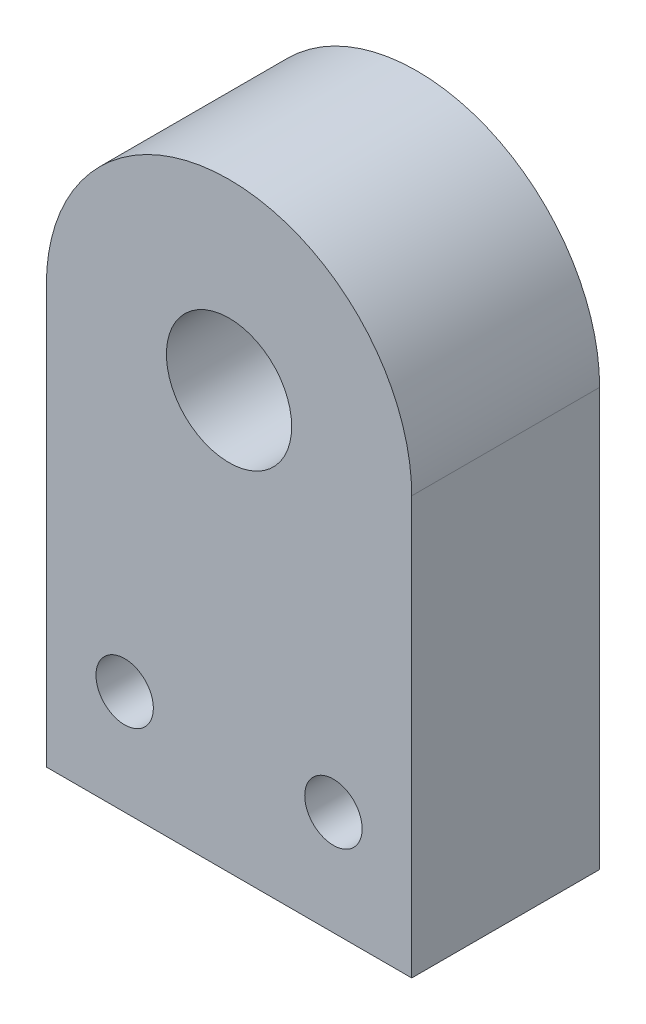
ISO-10303-21;
HEADER;
FILE_DESCRIPTION(('STEP AP214'),'2;1');
FILE_NAME('part.step','',(''),(''),'','','');
FILE_SCHEMA(('AUTOMOTIVE_DESIGN { 1 0 10303 214 1 1 1 1 }'));
ENDSEC;
DATA;
#1=APPLICATION_CONTEXT('core data for automotive mechanical design processes');
#2=APPLICATION_PROTOCOL_DEFINITION('international standard','automotive_design',2000,#1);
#3=PRODUCT_CONTEXT('',#1,'mechanical');
#4=PRODUCT('Part','Part','',(#3));
#5=PRODUCT_RELATED_PRODUCT_CATEGORY('part','',(#4));
#6=PRODUCT_DEFINITION_FORMATION('','',#4);
#7=PRODUCT_DEFINITION_CONTEXT('part definition',#1,'design');
#8=PRODUCT_DEFINITION('design','',#6,#7);
#9=PRODUCT_DEFINITION_SHAPE('','',#8);
#10=(LENGTH_UNIT() NAMED_UNIT(*) SI_UNIT(.MILLI.,.METRE.));
#11=(NAMED_UNIT(*) PLANE_ANGLE_UNIT() SI_UNIT($,.RADIAN.));
#12=(NAMED_UNIT(*) SI_UNIT($,.STERADIAN.) SOLID_ANGLE_UNIT());
#13=UNCERTAINTY_MEASURE_WITH_UNIT(LENGTH_MEASURE(1.E-05),#10,'distance_accuracy_value','');
#14=(GEOMETRIC_REPRESENTATION_CONTEXT(3) GLOBAL_UNCERTAINTY_ASSIGNED_CONTEXT((#13)) GLOBAL_UNIT_ASSIGNED_CONTEXT((#10,
#11,#12)) REPRESENTATION_CONTEXT('',''));
#15=CARTESIAN_POINT('',(0.,0.,0.));
#16=DIRECTION('',(0.,0.,1.));
#17=DIRECTION('',(1.,0.,0.));
#18=AXIS2_PLACEMENT_3D('',#15,#16,#17);
#19=CARTESIAN_POINT('',(0.,0.,18.));
#20=DIRECTION('',(0.,0.,1.));
#21=DIRECTION('',(1.,0.,0.));
#22=AXIS2_PLACEMENT_3D('',#19,#20,#21);
#23=PLANE('',#22);
#24=CARTESIAN_POINT('',(-9.99999999999999,-30.,18.));
#25=DIRECTION('',(0.,0.,1.));
#26=DIRECTION('',(1.,0.,0.));
#27=AXIS2_PLACEMENT_3D('',#24,#25,#26);
#28=CIRCLE('',#27,2.75);
#29=CARTESIAN_POINT('',(-7.24999999999999,-30.,18.));
#30=VERTEX_POINT('',#29);
#31=EDGE_CURVE('E117',#30,#30,#28,.T.);
#32=ORIENTED_EDGE('',*,*,#31,.F.);
#33=EDGE_LOOP('',(#32));
#34=FACE_BOUND('',#33,.T.);
#35=CARTESIAN_POINT('',(0.,0.,18.));
#36=DIRECTION('',(0.,0.,1.));
#37=DIRECTION('',(1.,0.,0.));
#38=AXIS2_PLACEMENT_3D('',#35,#36,#37);
#39=CIRCLE('',#38,17.5);
#40=CARTESIAN_POINT('',(17.5,0.,18.));
#41=VERTEX_POINT('',#40);
#42=CARTESIAN_POINT('',(-17.5,0.,18.));
#43=VERTEX_POINT('',#42);
#44=EDGE_CURVE('E87',#41,#43,#39,.T.);
#45=ORIENTED_EDGE('',*,*,#44,.T.);
#46=DIRECTION('',(0.,-1.,0.));
#47=VECTOR('',#46,1.);
#48=CARTESIAN_POINT('',(-17.5,0.,18.));
#49=LINE('',#48,#47);
#50=CARTESIAN_POINT('',(-17.5,-40.,18.));
#51=VERTEX_POINT('',#50);
#52=EDGE_CURVE('E82',#43,#51,#49,.T.);
#53=ORIENTED_EDGE('',*,*,#52,.T.);
#54=DIRECTION('',(1.,0.,0.));
#55=VECTOR('',#54,1.);
#56=CARTESIAN_POINT('',(-17.5,-40.,18.));
#57=LINE('',#56,#55);
#58=CARTESIAN_POINT('',(17.5,-40.,18.));
#59=VERTEX_POINT('',#58);
#60=EDGE_CURVE('E85',#51,#59,#57,.T.);
#61=ORIENTED_EDGE('',*,*,#60,.T.);
#62=DIRECTION('',(0.,1.,0.));
#63=VECTOR('',#62,1.);
#64=CARTESIAN_POINT('',(17.5,0.,18.));
#65=LINE('',#64,#63);
#66=EDGE_CURVE('E52',#59,#41,#65,.T.);
#67=ORIENTED_EDGE('',*,*,#66,.T.);
#68=EDGE_LOOP('',(#45,#53,#61,#67));
#69=FACE_BOUND('',#68,.T.);
#70=CARTESIAN_POINT('',(0.,0.,18.));
#71=DIRECTION('',(0.,0.,1.));
#72=DIRECTION('',(1.,0.,0.));
#73=AXIS2_PLACEMENT_3D('',#70,#71,#72);
#74=CIRCLE('',#73,6.);
#75=CARTESIAN_POINT('',(6.,0.,18.));
#76=VERTEX_POINT('',#75);
#77=EDGE_CURVE('E102',#76,#76,#74,.T.);
#78=ORIENTED_EDGE('',*,*,#77,.F.);
#79=EDGE_LOOP('',(#78));
#80=FACE_BOUND('',#79,.T.);
#81=CARTESIAN_POINT('',(10.,-30.,18.));
#82=DIRECTION('',(0.,0.,1.));
#83=DIRECTION('',(-1.,0.,0.));
#84=AXIS2_PLACEMENT_3D('',#81,#82,#83);
#85=CIRCLE('',#84,2.75);
#86=CARTESIAN_POINT('',(7.25000000000001,-30.,18.));
#87=VERTEX_POINT('',#86);
#88=EDGE_CURVE('E123',#87,#87,#85,.T.);
#89=ORIENTED_EDGE('',*,*,#88,.F.);
#90=EDGE_LOOP('',(#89));
#91=FACE_BOUND('',#90,.T.);
#92=ADVANCED_FACE('F35',(#34,#69,#80,#91),#23,.T.);
#93=CARTESIAN_POINT('',(0.,0.,0.));
#94=DIRECTION('',(0.,0.,1.));
#95=DIRECTION('',(1.,0.,0.));
#96=AXIS2_PLACEMENT_3D('',#93,#94,#95);
#97=PLANE('',#96);
#98=CARTESIAN_POINT('',(0.,0.,0.));
#99=DIRECTION('',(0.,0.,1.));
#100=DIRECTION('',(1.,0.,0.));
#101=AXIS2_PLACEMENT_3D('',#98,#99,#100);
#102=CIRCLE('',#101,17.5);
#103=CARTESIAN_POINT('',(17.5,0.,0.));
#104=VERTEX_POINT('',#103);
#105=CARTESIAN_POINT('',(-17.5,0.,0.));
#106=VERTEX_POINT('',#105);
#107=EDGE_CURVE('E99',#104,#106,#102,.T.);
#108=ORIENTED_EDGE('',*,*,#107,.F.);
#109=DIRECTION('',(0.,1.,0.));
#110=VECTOR('',#109,1.);
#111=CARTESIAN_POINT('',(17.5,0.,0.));
#112=LINE('',#111,#110);
#113=CARTESIAN_POINT('',(17.5,-40.,0.));
#114=VERTEX_POINT('',#113);
#115=EDGE_CURVE('E75',#114,#104,#112,.T.);
#116=ORIENTED_EDGE('',*,*,#115,.F.);
#117=DIRECTION('',(1.,0.,0.));
#118=VECTOR('',#117,1.);
#119=CARTESIAN_POINT('',(-17.5,-40.,0.));
#120=LINE('',#119,#118);
#121=CARTESIAN_POINT('',(-17.5,-40.,0.));
#122=VERTEX_POINT('',#121);
#123=EDGE_CURVE('E69',#122,#114,#120,.T.);
#124=ORIENTED_EDGE('',*,*,#123,.F.);
#125=DIRECTION('',(0.,-1.,0.));
#126=VECTOR('',#125,1.);
#127=CARTESIAN_POINT('',(-17.5,0.,0.));
#128=LINE('',#127,#126);
#129=EDGE_CURVE('E91',#106,#122,#128,.T.);
#130=ORIENTED_EDGE('',*,*,#129,.F.);
#131=EDGE_LOOP('',(#108,#116,#124,#130));
#132=FACE_BOUND('',#131,.T.);
#133=CARTESIAN_POINT('',(0.,0.,0.));
#134=DIRECTION('',(0.,0.,1.));
#135=DIRECTION('',(1.,0.,0.));
#136=AXIS2_PLACEMENT_3D('',#133,#134,#135);
#137=CIRCLE('',#136,6.);
#138=CARTESIAN_POINT('',(6.,0.,0.));
#139=VERTEX_POINT('',#138);
#140=EDGE_CURVE('E114',#139,#139,#137,.T.);
#141=ORIENTED_EDGE('',*,*,#140,.T.);
#142=EDGE_LOOP('',(#141));
#143=FACE_BOUND('',#142,.T.);
#144=CARTESIAN_POINT('',(-9.99999999999999,-30.,0.));
#145=DIRECTION('',(0.,0.,1.));
#146=DIRECTION('',(1.,0.,0.));
#147=AXIS2_PLACEMENT_3D('',#144,#145,#146);
#148=CIRCLE('',#147,2.75);
#149=CARTESIAN_POINT('',(-7.24999999999999,-30.,0.));
#150=VERTEX_POINT('',#149);
#151=EDGE_CURVE('E120',#150,#150,#148,.T.);
#152=ORIENTED_EDGE('',*,*,#151,.T.);
#153=EDGE_LOOP('',(#152));
#154=FACE_BOUND('',#153,.T.);
#155=CARTESIAN_POINT('',(10.,-30.,0.));
#156=DIRECTION('',(0.,0.,1.));
#157=DIRECTION('',(-1.,0.,0.));
#158=AXIS2_PLACEMENT_3D('',#155,#156,#157);
#159=CIRCLE('',#158,2.75);
#160=CARTESIAN_POINT('',(7.25000000000001,-30.,0.));
#161=VERTEX_POINT('',#160);
#162=EDGE_CURVE('E126',#161,#161,#159,.T.);
#163=ORIENTED_EDGE('',*,*,#162,.T.);
#164=EDGE_LOOP('',(#163));
#165=FACE_BOUND('',#164,.T.);
#166=ADVANCED_FACE('F110',(#132,#143,#154,#165),#97,.F.);
#167=CARTESIAN_POINT('',(0.,0.,18.));
#168=DIRECTION('',(0.,0.,-1.));
#169=DIRECTION('',(-1.,0.,0.));
#170=AXIS2_PLACEMENT_3D('',#167,#168,#169);
#171=CYLINDRICAL_SURFACE('',#170,17.5);
#172=ORIENTED_EDGE('',*,*,#107,.T.);
#173=DIRECTION('',(0.,0.,-1.));
#174=VECTOR('',#173,1.);
#175=CARTESIAN_POINT('',(-17.5,0.,18.));
#176=LINE('',#175,#174);
#177=EDGE_CURVE('E11',#43,#106,#176,.T.);
#178=ORIENTED_EDGE('',*,*,#177,.F.);
#179=ORIENTED_EDGE('',*,*,#44,.F.);
#180=DIRECTION('',(0.,0.,-1.));
#181=VECTOR('',#180,1.);
#182=CARTESIAN_POINT('',(17.5,0.,18.));
#183=LINE('',#182,#181);
#184=EDGE_CURVE('E95',#41,#104,#183,.T.);
#185=ORIENTED_EDGE('',*,*,#184,.T.);
#186=EDGE_LOOP('',(#172,#178,#179,#185));
#187=FACE_BOUND('',#186,.T.);
#188=ADVANCED_FACE('F37',(#187),#171,.T.);
#189=CARTESIAN_POINT('',(-17.5,0.,18.));
#190=DIRECTION('',(1.,0.,0.));
#191=DIRECTION('',(0.,1.,0.));
#192=AXIS2_PLACEMENT_3D('',#189,#190,#191);
#193=PLANE('',#192);
#194=ORIENTED_EDGE('',*,*,#129,.T.);
#195=DIRECTION('',(0.,0.,-1.));
#196=VECTOR('',#195,1.);
#197=CARTESIAN_POINT('',(-17.5,-40.,18.));
#198=LINE('',#197,#196);
#199=EDGE_CURVE('E44',#51,#122,#198,.T.);
#200=ORIENTED_EDGE('',*,*,#199,.F.);
#201=ORIENTED_EDGE('',*,*,#52,.F.);
#202=ORIENTED_EDGE('',*,*,#177,.T.);
#203=EDGE_LOOP('',(#194,#200,#201,#202));
#204=FACE_BOUND('',#203,.T.);
#205=ADVANCED_FACE('F90',(#204),#193,.F.);
#206=CARTESIAN_POINT('',(-17.5,-40.,18.));
#207=DIRECTION('',(0.,1.,0.));
#208=DIRECTION('',(-1.,0.,0.));
#209=AXIS2_PLACEMENT_3D('',#206,#207,#208);
#210=PLANE('',#209);
#211=ORIENTED_EDGE('',*,*,#123,.T.);
#212=DIRECTION('',(0.,0.,-1.));
#213=VECTOR('',#212,1.);
#214=CARTESIAN_POINT('',(17.5,-40.,18.));
#215=LINE('',#214,#213);
#216=EDGE_CURVE('E92',#59,#114,#215,.T.);
#217=ORIENTED_EDGE('',*,*,#216,.F.);
#218=ORIENTED_EDGE('',*,*,#60,.F.);
#219=ORIENTED_EDGE('',*,*,#199,.T.);
#220=EDGE_LOOP('',(#211,#217,#218,#219));
#221=FACE_BOUND('',#220,.T.);
#222=ADVANCED_FACE('F93',(#221),#210,.F.);
#223=CARTESIAN_POINT('',(17.5,0.,18.));
#224=DIRECTION('',(-1.,0.,0.));
#225=DIRECTION('',(0.,-1.,0.));
#226=AXIS2_PLACEMENT_3D('',#223,#224,#225);
#227=PLANE('',#226);
#228=ORIENTED_EDGE('',*,*,#115,.T.);
#229=ORIENTED_EDGE('',*,*,#184,.F.);
#230=ORIENTED_EDGE('',*,*,#66,.F.);
#231=ORIENTED_EDGE('',*,*,#216,.T.);
#232=EDGE_LOOP('',(#228,#229,#230,#231));
#233=FACE_BOUND('',#232,.T.);
#234=ADVANCED_FACE('F107',(#233),#227,.F.);
#235=CARTESIAN_POINT('',(0.,0.,18.));
#236=DIRECTION('',(0.,0.,-1.));
#237=DIRECTION('',(-1.,0.,0.));
#238=AXIS2_PLACEMENT_3D('',#235,#236,#237);
#239=CYLINDRICAL_SURFACE('',#238,6.);
#240=ORIENTED_EDGE('',*,*,#77,.T.);
#241=EDGE_LOOP('',(#240));
#242=FACE_BOUND('',#241,.T.);
#243=ORIENTED_EDGE('',*,*,#140,.F.);
#244=EDGE_LOOP('',(#243));
#245=FACE_BOUND('',#244,.T.);
#246=ADVANCED_FACE('F144',(#242,#245),#239,.F.);
#247=CARTESIAN_POINT('',(-9.99999999999999,-30.,18.));
#248=DIRECTION('',(0.,0.,-1.));
#249=DIRECTION('',(-1.,0.,0.));
#250=AXIS2_PLACEMENT_3D('',#247,#248,#249);
#251=CYLINDRICAL_SURFACE('',#250,2.75);
#252=ORIENTED_EDGE('',*,*,#31,.T.);
#253=EDGE_LOOP('',(#252));
#254=FACE_BOUND('',#253,.T.);
#255=ORIENTED_EDGE('',*,*,#151,.F.);
#256=EDGE_LOOP('',(#255));
#257=FACE_BOUND('',#256,.T.);
#258=ADVANCED_FACE('F190',(#254,#257),#251,.F.);
#259=CARTESIAN_POINT('',(10.,-30.,18.));
#260=DIRECTION('',(0.,0.,-1.));
#261=DIRECTION('',(-1.,0.,0.));
#262=AXIS2_PLACEMENT_3D('',#259,#260,#261);
#263=CYLINDRICAL_SURFACE('',#262,2.75);
#264=ORIENTED_EDGE('',*,*,#88,.T.);
#265=EDGE_LOOP('',(#264));
#266=FACE_BOUND('',#265,.T.);
#267=ORIENTED_EDGE('',*,*,#162,.F.);
#268=EDGE_LOOP('',(#267));
#269=FACE_BOUND('',#268,.T.);
#270=ADVANCED_FACE('F132',(#266,#269),#263,.F.);
#271=CLOSED_SHELL('',(#92,#166,#188,#205,#222,#234,#246,#258,#270));
#272=MANIFOLD_SOLID_BREP('B2',#271);
#273=ADVANCED_BREP_SHAPE_REPRESENTATION('',(#18,#272),#14);
#274=SHAPE_DEFINITION_REPRESENTATION(#9,#273);
ENDSEC;
END-ISO-10303-21;
